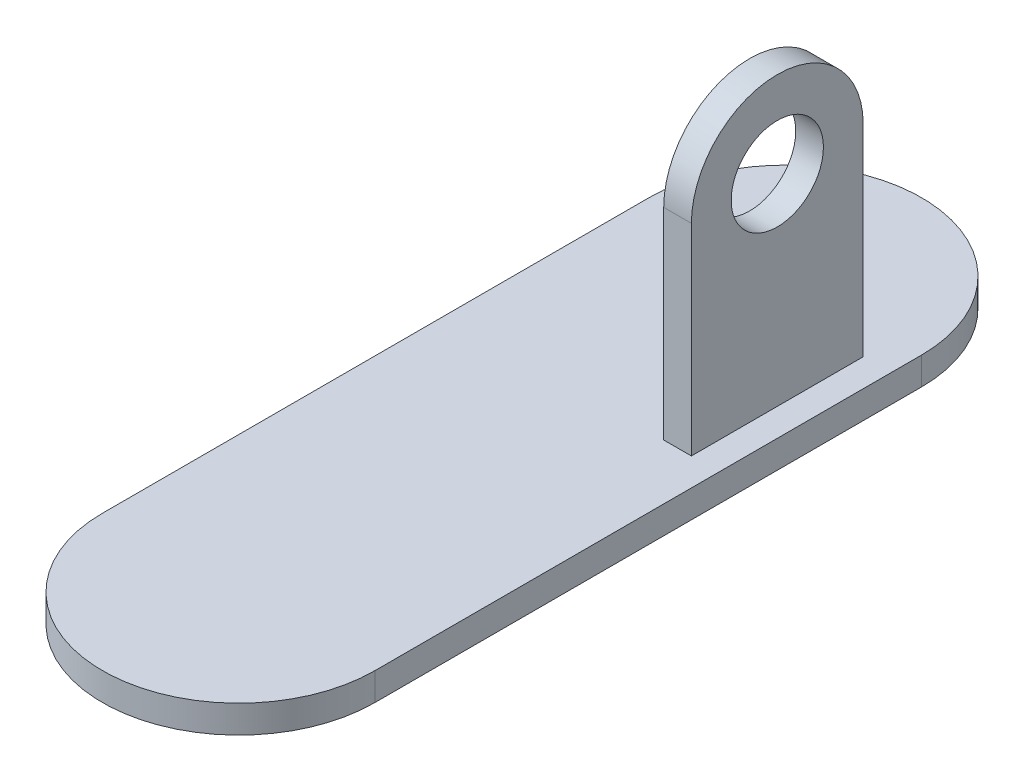
ISO-10303-21;
HEADER;
FILE_DESCRIPTION(('STEP AP214'),'2;1');
FILE_NAME('part.step','',(''),(''),'','','');
FILE_SCHEMA(('AUTOMOTIVE_DESIGN { 1 0 10303 214 1 1 1 1 }'));
ENDSEC;
DATA;
#1=APPLICATION_CONTEXT('core data for automotive mechanical design processes');
#2=APPLICATION_PROTOCOL_DEFINITION('international standard','automotive_design',2000,#1);
#3=PRODUCT_CONTEXT('',#1,'mechanical');
#4=PRODUCT('Part','Part','',(#3));
#5=PRODUCT_RELATED_PRODUCT_CATEGORY('part','',(#4));
#6=PRODUCT_DEFINITION_FORMATION('','',#4);
#7=PRODUCT_DEFINITION_CONTEXT('part definition',#1,'design');
#8=PRODUCT_DEFINITION('design','',#6,#7);
#9=PRODUCT_DEFINITION_SHAPE('','',#8);
#10=(LENGTH_UNIT() NAMED_UNIT(*) SI_UNIT(.MILLI.,.METRE.));
#11=(NAMED_UNIT(*) PLANE_ANGLE_UNIT() SI_UNIT($,.RADIAN.));
#12=(NAMED_UNIT(*) SI_UNIT($,.STERADIAN.) SOLID_ANGLE_UNIT());
#13=UNCERTAINTY_MEASURE_WITH_UNIT(LENGTH_MEASURE(1.E-05),#10,'distance_accuracy_value','');
#14=(GEOMETRIC_REPRESENTATION_CONTEXT(3) GLOBAL_UNCERTAINTY_ASSIGNED_CONTEXT((#13)) GLOBAL_UNIT_ASSIGNED_CONTEXT((#10,
#11,#12)) REPRESENTATION_CONTEXT('',''));
#15=CARTESIAN_POINT('',(0.,0.,0.));
#16=DIRECTION('',(0.,0.,1.));
#17=DIRECTION('',(1.,0.,0.));
#18=AXIS2_PLACEMENT_3D('',#15,#16,#17);
#19=CARTESIAN_POINT('',(0.,9.,-88.9));
#20=DIRECTION('',(0.,1.,0.));
#21=DIRECTION('',(0.,0.,1.));
#22=AXIS2_PLACEMENT_3D('',#19,#20,#21);
#23=PLANE('',#22);
#24=CARTESIAN_POINT('',(0.,9.,-88.9));
#25=DIRECTION('',(0.,1.,0.));
#26=DIRECTION('',(0.,0.,1.));
#27=AXIS2_PLACEMENT_3D('',#24,#25,#26);
#28=CIRCLE('',#27,44.323);
#29=CARTESIAN_POINT('',(44.323,9.,-88.9));
#30=VERTEX_POINT('',#29);
#31=CARTESIAN_POINT('',(-44.323,9.,-88.9));
#32=VERTEX_POINT('',#31);
#33=EDGE_CURVE('E181',#30,#32,#28,.T.);
#34=ORIENTED_EDGE('',*,*,#33,.T.);
#35=DIRECTION('',(0.,0.,1.));
#36=VECTOR('',#35,1.);
#37=CARTESIAN_POINT('',(-44.323,9.,-88.9));
#38=LINE('',#37,#36);
#39=CARTESIAN_POINT('',(-44.323,9.,88.9));
#40=VERTEX_POINT('',#39);
#41=EDGE_CURVE('E105',#32,#40,#38,.T.);
#42=ORIENTED_EDGE('',*,*,#41,.T.);
#43=CARTESIAN_POINT('',(0.,9.,88.9));
#44=DIRECTION('',(0.,1.,0.));
#45=DIRECTION('',(0.,0.,1.));
#46=AXIS2_PLACEMENT_3D('',#43,#44,#45);
#47=CIRCLE('',#46,44.323);
#48=CARTESIAN_POINT('',(44.323,9.,88.9));
#49=VERTEX_POINT('',#48);
#50=EDGE_CURVE('E240',#40,#49,#47,.T.);
#51=ORIENTED_EDGE('',*,*,#50,.T.);
#52=DIRECTION('',(0.,0.,-1.));
#53=VECTOR('',#52,1.);
#54=CARTESIAN_POINT('',(44.323,9.,-88.9));
#55=LINE('',#54,#53);
#56=EDGE_CURVE('E77',#49,#30,#55,.T.);
#57=ORIENTED_EDGE('',*,*,#56,.T.);
#58=EDGE_LOOP('',(#34,#42,#51,#57));
#59=FACE_BOUND('',#58,.T.);
#60=DIRECTION('',(1.,0.,0.));
#61=VECTOR('',#60,1.);
#62=CARTESIAN_POINT('',(26.323,9.,-23.02));
#63=LINE('',#62,#61);
#64=CARTESIAN_POINT('',(26.323,9.,-23.02));
#65=VERTEX_POINT('',#64);
#66=CARTESIAN_POINT('',(35.323,9.,-23.02));
#67=VERTEX_POINT('',#66);
#68=EDGE_CURVE('E159',#65,#67,#63,.T.);
#69=ORIENTED_EDGE('',*,*,#68,.F.);
#70=DIRECTION('',(0.,0.,1.));
#71=VECTOR('',#70,1.);
#72=CARTESIAN_POINT('',(26.323,9.,-78.9));
#73=LINE('',#72,#71);
#74=CARTESIAN_POINT('',(26.323,9.,-78.9));
#75=VERTEX_POINT('',#74);
#76=EDGE_CURVE('E134',#75,#65,#73,.T.);
#77=ORIENTED_EDGE('',*,*,#76,.F.);
#78=DIRECTION('',(-1.,0.,0.));
#79=VECTOR('',#78,1.);
#80=CARTESIAN_POINT('',(26.323,9.,-78.9));
#81=LINE('',#80,#79);
#82=CARTESIAN_POINT('',(35.323,9.,-78.9));
#83=VERTEX_POINT('',#82);
#84=EDGE_CURVE('E150',#83,#75,#81,.T.);
#85=ORIENTED_EDGE('',*,*,#84,.F.);
#86=DIRECTION('',(0.,0.,-1.));
#87=VECTOR('',#86,1.);
#88=CARTESIAN_POINT('',(35.323,9.,-78.9));
#89=LINE('',#88,#87);
#90=EDGE_CURVE('E170',#67,#83,#89,.T.);
#91=ORIENTED_EDGE('',*,*,#90,.F.);
#92=EDGE_LOOP('',(#69,#77,#85,#91));
#93=FACE_BOUND('',#92,.T.);
#94=ADVANCED_FACE('F52',(#59,#93),#23,.T.);
#95=CARTESIAN_POINT('',(0.,9.,-88.9));
#96=DIRECTION('',(0.,-1.,0.));
#97=DIRECTION('',(0.,0.,-1.));
#98=AXIS2_PLACEMENT_3D('',#95,#96,#97);
#99=CYLINDRICAL_SURFACE('',#98,44.323);
#100=CARTESIAN_POINT('',(0.,0.,-88.9));
#101=DIRECTION('',(0.,1.,0.));
#102=DIRECTION('',(0.,0.,1.));
#103=AXIS2_PLACEMENT_3D('',#100,#101,#102);
#104=CIRCLE('',#103,44.323);
#105=CARTESIAN_POINT('',(44.323,0.,-88.9));
#106=VERTEX_POINT('',#105);
#107=CARTESIAN_POINT('',(-44.323,0.,-88.9));
#108=VERTEX_POINT('',#107);
#109=EDGE_CURVE('E138',#106,#108,#104,.T.);
#110=ORIENTED_EDGE('',*,*,#109,.T.);
#111=DIRECTION('',(0.,-1.,0.));
#112=VECTOR('',#111,1.);
#113=CARTESIAN_POINT('',(-44.323,9.,-88.9));
#114=LINE('',#113,#112);
#115=EDGE_CURVE('E12',#32,#108,#114,.T.);
#116=ORIENTED_EDGE('',*,*,#115,.F.);
#117=ORIENTED_EDGE('',*,*,#33,.F.);
#118=DIRECTION('',(0.,-1.,0.));
#119=VECTOR('',#118,1.);
#120=CARTESIAN_POINT('',(44.323,9.,-88.9));
#121=LINE('',#120,#119);
#122=EDGE_CURVE('E249',#30,#106,#121,.T.);
#123=ORIENTED_EDGE('',*,*,#122,.T.);
#124=EDGE_LOOP('',(#110,#116,#117,#123));
#125=FACE_BOUND('',#124,.T.);
#126=ADVANCED_FACE('F54',(#125),#99,.T.);
#127=CARTESIAN_POINT('',(-44.323,9.,-88.9));
#128=DIRECTION('',(1.,0.,0.));
#129=DIRECTION('',(0.,0.,-1.));
#130=AXIS2_PLACEMENT_3D('',#127,#128,#129);
#131=PLANE('',#130);
#132=DIRECTION('',(0.,0.,1.));
#133=VECTOR('',#132,1.);
#134=CARTESIAN_POINT('',(-44.323,0.,-88.9));
#135=LINE('',#134,#133);
#136=CARTESIAN_POINT('',(-44.323,0.,88.9));
#137=VERTEX_POINT('',#136);
#138=EDGE_CURVE('E229',#108,#137,#135,.T.);
#139=ORIENTED_EDGE('',*,*,#138,.T.);
#140=DIRECTION('',(0.,-1.,0.));
#141=VECTOR('',#140,1.);
#142=CARTESIAN_POINT('',(-44.323,9.,88.9));
#143=LINE('',#142,#141);
#144=EDGE_CURVE('E61',#40,#137,#143,.T.);
#145=ORIENTED_EDGE('',*,*,#144,.F.);
#146=ORIENTED_EDGE('',*,*,#41,.F.);
#147=ORIENTED_EDGE('',*,*,#115,.T.);
#148=EDGE_LOOP('',(#139,#145,#146,#147));
#149=FACE_BOUND('',#148,.T.);
#150=ADVANCED_FACE('F210',(#149),#131,.F.);
#151=CARTESIAN_POINT('',(0.,9.,88.9));
#152=DIRECTION('',(0.,-1.,0.));
#153=DIRECTION('',(0.,0.,-1.));
#154=AXIS2_PLACEMENT_3D('',#151,#152,#153);
#155=CYLINDRICAL_SURFACE('',#154,44.323);
#156=CARTESIAN_POINT('',(0.,0.,88.9));
#157=DIRECTION('',(0.,1.,0.));
#158=DIRECTION('',(0.,0.,1.));
#159=AXIS2_PLACEMENT_3D('',#156,#157,#158);
#160=CIRCLE('',#159,44.323);
#161=CARTESIAN_POINT('',(44.323,0.,88.9));
#162=VERTEX_POINT('',#161);
#163=EDGE_CURVE('E237',#137,#162,#160,.T.);
#164=ORIENTED_EDGE('',*,*,#163,.T.);
#165=DIRECTION('',(0.,-1.,0.));
#166=VECTOR('',#165,1.);
#167=CARTESIAN_POINT('',(44.323,9.,88.9));
#168=LINE('',#167,#166);
#169=EDGE_CURVE('E242',#49,#162,#168,.T.);
#170=ORIENTED_EDGE('',*,*,#169,.F.);
#171=ORIENTED_EDGE('',*,*,#50,.F.);
#172=ORIENTED_EDGE('',*,*,#144,.T.);
#173=EDGE_LOOP('',(#164,#170,#171,#172));
#174=FACE_BOUND('',#173,.T.);
#175=ADVANCED_FACE('F223',(#174),#155,.T.);
#176=CARTESIAN_POINT('',(44.323,9.,-88.9));
#177=DIRECTION('',(-1.,0.,0.));
#178=DIRECTION('',(0.,0.,1.));
#179=AXIS2_PLACEMENT_3D('',#176,#177,#178);
#180=PLANE('',#179);
#181=DIRECTION('',(0.,0.,-1.));
#182=VECTOR('',#181,1.);
#183=CARTESIAN_POINT('',(44.323,0.,-88.9));
#184=LINE('',#183,#182);
#185=EDGE_CURVE('E98',#162,#106,#184,.T.);
#186=ORIENTED_EDGE('',*,*,#185,.T.);
#187=ORIENTED_EDGE('',*,*,#122,.F.);
#188=ORIENTED_EDGE('',*,*,#56,.F.);
#189=ORIENTED_EDGE('',*,*,#169,.T.);
#190=EDGE_LOOP('',(#186,#187,#188,#189));
#191=FACE_BOUND('',#190,.T.);
#192=ADVANCED_FACE('F219',(#191),#180,.F.);
#193=CARTESIAN_POINT('',(0.,0.,-88.9));
#194=DIRECTION('',(0.,1.,0.));
#195=DIRECTION('',(0.,0.,1.));
#196=AXIS2_PLACEMENT_3D('',#193,#194,#195);
#197=PLANE('',#196);
#198=ORIENTED_EDGE('',*,*,#109,.F.);
#199=ORIENTED_EDGE('',*,*,#185,.F.);
#200=ORIENTED_EDGE('',*,*,#163,.F.);
#201=ORIENTED_EDGE('',*,*,#138,.F.);
#202=EDGE_LOOP('',(#198,#199,#200,#201));
#203=FACE_BOUND('',#202,.T.);
#204=ADVANCED_FACE('F216',(#203),#197,.F.);
#205=CARTESIAN_POINT('',(26.323,74.53,-78.9));
#206=DIRECTION('',(1.,0.,0.));
#207=DIRECTION('',(0.,0.,-1.));
#208=AXIS2_PLACEMENT_3D('',#205,#206,#207);
#209=PLANE('',#208);
#210=CARTESIAN_POINT('',(26.323,74.53,-50.96));
#211=DIRECTION('',(1.,0.,0.));
#212=DIRECTION('',(0.,0.,-1.));
#213=AXIS2_PLACEMENT_3D('',#210,#211,#212);
#214=CIRCLE('',#213,15.);
#215=CARTESIAN_POINT('',(26.323,74.53,-65.96));
#216=VERTEX_POINT('',#215);
#217=EDGE_CURVE('E161',#216,#216,#214,.T.);
#218=ORIENTED_EDGE('',*,*,#217,.T.);
#219=EDGE_LOOP('',(#218));
#220=FACE_BOUND('',#219,.T.);
#221=DIRECTION('',(0.,-1.,0.));
#222=VECTOR('',#221,1.);
#223=CARTESIAN_POINT('',(26.323,74.53,-23.02));
#224=LINE('',#223,#222);
#225=CARTESIAN_POINT('',(26.323,74.53,-23.02));
#226=VERTEX_POINT('',#225);
#227=EDGE_CURVE('E127',#226,#65,#224,.T.);
#228=ORIENTED_EDGE('',*,*,#227,.F.);
#229=CARTESIAN_POINT('',(26.323,74.53,-50.96));
#230=DIRECTION('',(1.,0.,0.));
#231=DIRECTION('',(0.,0.,-1.));
#232=AXIS2_PLACEMENT_3D('',#229,#230,#231);
#233=CIRCLE('',#232,27.94);
#234=CARTESIAN_POINT('',(26.323,74.53,-78.9));
#235=VERTEX_POINT('',#234);
#236=EDGE_CURVE('E132',#226,#235,#233,.F.);
#237=ORIENTED_EDGE('',*,*,#236,.T.);
#238=DIRECTION('',(0.,-1.,0.));
#239=VECTOR('',#238,1.);
#240=CARTESIAN_POINT('',(26.323,74.53,-78.9));
#241=LINE('',#240,#239);
#242=EDGE_CURVE('E166',#235,#75,#241,.T.);
#243=ORIENTED_EDGE('',*,*,#242,.T.);
#244=ORIENTED_EDGE('',*,*,#76,.T.);
#245=EDGE_LOOP('',(#228,#237,#243,#244));
#246=FACE_BOUND('',#245,.T.);
#247=ADVANCED_FACE('F129',(#220,#246),#209,.F.);
#248=CARTESIAN_POINT('',(26.323,74.53,-23.02));
#249=DIRECTION('',(0.,0.,-1.));
#250=DIRECTION('',(-1.,0.,0.));
#251=AXIS2_PLACEMENT_3D('',#248,#249,#250);
#252=PLANE('',#251);
#253=ORIENTED_EDGE('',*,*,#68,.T.);
#254=DIRECTION('',(0.,-1.,0.));
#255=VECTOR('',#254,1.);
#256=CARTESIAN_POINT('',(35.323,74.53,-23.02));
#257=LINE('',#256,#255);
#258=CARTESIAN_POINT('',(35.323,74.53,-23.02));
#259=VERTEX_POINT('',#258);
#260=EDGE_CURVE('E139',#259,#67,#257,.T.);
#261=ORIENTED_EDGE('',*,*,#260,.F.);
#262=DIRECTION('',(1.,0.,0.));
#263=VECTOR('',#262,1.);
#264=CARTESIAN_POINT('',(26.323,74.53,-23.02));
#265=LINE('',#264,#263);
#266=EDGE_CURVE('E142',#226,#259,#265,.T.);
#267=ORIENTED_EDGE('',*,*,#266,.F.);
#268=ORIENTED_EDGE('',*,*,#227,.T.);
#269=EDGE_LOOP('',(#253,#261,#267,#268));
#270=FACE_BOUND('',#269,.T.);
#271=ADVANCED_FACE('F143',(#270),#252,.F.);
#272=CARTESIAN_POINT('',(35.323,74.53,-78.9));
#273=DIRECTION('',(-1.,0.,0.));
#274=DIRECTION('',(0.,0.,1.));
#275=AXIS2_PLACEMENT_3D('',#272,#273,#274);
#276=PLANE('',#275);
#277=CARTESIAN_POINT('',(35.323,74.53,-50.96));
#278=DIRECTION('',(1.,0.,0.));
#279=DIRECTION('',(0.,0.,-1.));
#280=AXIS2_PLACEMENT_3D('',#277,#278,#279);
#281=CIRCLE('',#280,15.);
#282=CARTESIAN_POINT('',(35.323,74.53,-65.96));
#283=VERTEX_POINT('',#282);
#284=EDGE_CURVE('E188',#283,#283,#281,.T.);
#285=ORIENTED_EDGE('',*,*,#284,.F.);
#286=EDGE_LOOP('',(#285));
#287=FACE_BOUND('',#286,.T.);
#288=DIRECTION('',(0.,-1.,0.));
#289=VECTOR('',#288,1.);
#290=CARTESIAN_POINT('',(35.323,74.53,-78.9));
#291=LINE('',#290,#289);
#292=CARTESIAN_POINT('',(35.323,74.53,-78.9));
#293=VERTEX_POINT('',#292);
#294=EDGE_CURVE('E68',#293,#83,#291,.T.);
#295=ORIENTED_EDGE('',*,*,#294,.F.);
#296=CARTESIAN_POINT('',(35.323,74.53,-50.96));
#297=DIRECTION('',(1.,0.,0.));
#298=DIRECTION('',(0.,0.,-1.));
#299=AXIS2_PLACEMENT_3D('',#296,#297,#298);
#300=CIRCLE('',#299,27.94);
#301=EDGE_CURVE('E155',#293,#259,#300,.T.);
#302=ORIENTED_EDGE('',*,*,#301,.T.);
#303=ORIENTED_EDGE('',*,*,#260,.T.);
#304=ORIENTED_EDGE('',*,*,#90,.T.);
#305=EDGE_LOOP('',(#295,#302,#303,#304));
#306=FACE_BOUND('',#305,.T.);
#307=ADVANCED_FACE('F288',(#287,#306),#276,.F.);
#308=CARTESIAN_POINT('',(26.323,74.53,-78.9));
#309=DIRECTION('',(0.,0.,1.));
#310=DIRECTION('',(1.,0.,0.));
#311=AXIS2_PLACEMENT_3D('',#308,#309,#310);
#312=PLANE('',#311);
#313=ORIENTED_EDGE('',*,*,#84,.T.);
#314=ORIENTED_EDGE('',*,*,#242,.F.);
#315=DIRECTION('',(-1.,0.,0.));
#316=VECTOR('',#315,1.);
#317=CARTESIAN_POINT('',(26.323,74.53,-78.9));
#318=LINE('',#317,#316);
#319=EDGE_CURVE('E149',#293,#235,#318,.T.);
#320=ORIENTED_EDGE('',*,*,#319,.F.);
#321=ORIENTED_EDGE('',*,*,#294,.T.);
#322=EDGE_LOOP('',(#313,#314,#320,#321));
#323=FACE_BOUND('',#322,.T.);
#324=ADVANCED_FACE('F205',(#323),#312,.F.);
#325=CARTESIAN_POINT('',(-52.7032538654085,74.53,-50.96));
#326=DIRECTION('',(1.,0.,0.));
#327=DIRECTION('',(0.,0.,-1.));
#328=AXIS2_PLACEMENT_3D('',#325,#326,#327);
#329=CYLINDRICAL_SURFACE('',#328,27.94);
#330=ORIENTED_EDGE('',*,*,#236,.F.);
#331=ORIENTED_EDGE('',*,*,#266,.T.);
#332=ORIENTED_EDGE('',*,*,#301,.F.);
#333=ORIENTED_EDGE('',*,*,#319,.T.);
#334=EDGE_LOOP('',(#330,#331,#332,#333));
#335=FACE_BOUND('',#334,.T.);
#336=ADVANCED_FACE('F153',(#335),#329,.T.);
#337=CARTESIAN_POINT('',(-44.323,74.53,-50.96));
#338=DIRECTION('',(1.,0.,0.));
#339=DIRECTION('',(0.,0.,-1.));
#340=AXIS2_PLACEMENT_3D('',#337,#338,#339);
#341=CYLINDRICAL_SURFACE('',#340,15.);
#342=ORIENTED_EDGE('',*,*,#284,.T.);
#343=EDGE_LOOP('',(#342));
#344=FACE_BOUND('',#343,.T.);
#345=ORIENTED_EDGE('',*,*,#217,.F.);
#346=EDGE_LOOP('',(#345));
#347=FACE_BOUND('',#346,.T.);
#348=ADVANCED_FACE('F197',(#344,#347),#341,.F.);
#349=CLOSED_SHELL('',(#94,#126,#150,#175,#192,#204,#247,#271,#307,#324,#336,#348));
#350=MANIFOLD_SOLID_BREP('B2',#349);
#351=ADVANCED_BREP_SHAPE_REPRESENTATION('',(#18,#350),#14);
#352=SHAPE_DEFINITION_REPRESENTATION(#9,#351);
ENDSEC;
END-ISO-10303-21;
